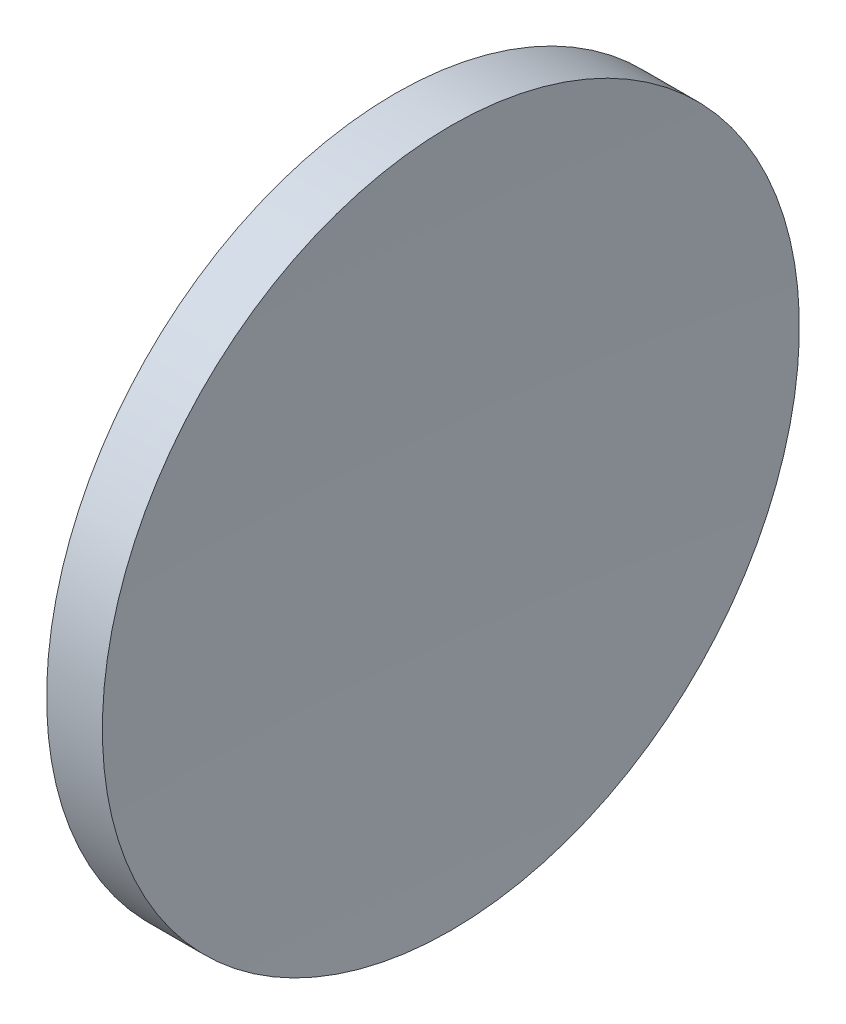
ISO-10303-21;
HEADER;
FILE_DESCRIPTION(('STEP AP214'),'2;1');
FILE_NAME('part.step','',(''),(''),'','','');
FILE_SCHEMA(('AUTOMOTIVE_DESIGN { 1 0 10303 214 1 1 1 1 }'));
ENDSEC;
DATA;
#1=APPLICATION_CONTEXT('core data for automotive mechanical design processes');
#2=APPLICATION_PROTOCOL_DEFINITION('international standard','automotive_design',2000,#1);
#3=PRODUCT_CONTEXT('',#1,'mechanical');
#4=PRODUCT('Part','Part','',(#3));
#5=PRODUCT_RELATED_PRODUCT_CATEGORY('part','',(#4));
#6=PRODUCT_DEFINITION_FORMATION('','',#4);
#7=PRODUCT_DEFINITION_CONTEXT('part definition',#1,'design');
#8=PRODUCT_DEFINITION('design','',#6,#7);
#9=PRODUCT_DEFINITION_SHAPE('','',#8);
#10=(LENGTH_UNIT() NAMED_UNIT(*) SI_UNIT(.MILLI.,.METRE.));
#11=(NAMED_UNIT(*) PLANE_ANGLE_UNIT() SI_UNIT($,.RADIAN.));
#12=(NAMED_UNIT(*) SI_UNIT($,.STERADIAN.) SOLID_ANGLE_UNIT());
#13=UNCERTAINTY_MEASURE_WITH_UNIT(LENGTH_MEASURE(1.E-05),#10,'distance_accuracy_value','');
#14=(GEOMETRIC_REPRESENTATION_CONTEXT(3) GLOBAL_UNCERTAINTY_ASSIGNED_CONTEXT((#13)) GLOBAL_UNIT_ASSIGNED_CONTEXT((#10,
#11,#12)) REPRESENTATION_CONTEXT('',''));
#15=CARTESIAN_POINT('',(0.,0.,0.));
#16=DIRECTION('',(0.,0.,1.));
#17=DIRECTION('',(1.,0.,0.));
#18=AXIS2_PLACEMENT_3D('',#15,#16,#17);
#19=CARTESIAN_POINT('',(506.755421315556,65.2168404709402,0.));
#20=DIRECTION('',(-1.,0.,0.));
#21=DIRECTION('',(0.,1.,0.));
#22=AXIS2_PLACEMENT_3D('',#19,#20,#21);
#23=SPHERICAL_SURFACE('',#22,380.);
#24=CARTESIAN_POINT('',(127.231970953131,65.2168404709403,0.));
#25=DIRECTION('',(-1.,0.,0.));
#26=DIRECTION('',(0.,-1.,0.));
#27=AXIS2_PLACEMENT_3D('',#24,#25,#26);
#28=CIRCLE('',#27,19.025);
#29=CARTESIAN_POINT('',(127.231970953131,46.1918404709403,0.));
#30=VERTEX_POINT('',#29);
#31=EDGE_CURVE('E10',#30,#30,#28,.T.);
#32=ORIENTED_EDGE('',*,*,#31,.F.);
#33=EDGE_LOOP('',(#32));
#34=FACE_BOUND('',#33,.T.);
#35=ADVANCED_FACE('F35',(#34),#23,.F.);
#36=CARTESIAN_POINT('',(115.944491297963,65.2168404709403,0.));
#37=DIRECTION('',(-1.,0.,0.));
#38=DIRECTION('',(0.,-1.,0.));
#39=AXIS2_PLACEMENT_3D('',#36,#37,#38);
#40=CYLINDRICAL_SURFACE('',#39,19.025);
#41=CARTESIAN_POINT('',(124.189724284792,65.2168404709403,0.));
#42=DIRECTION('',(-1.,0.,0.));
#43=DIRECTION('',(0.,-1.,0.));
#44=AXIS2_PLACEMENT_3D('',#41,#42,#43);
#45=CIRCLE('',#44,19.025);
#46=CARTESIAN_POINT('',(124.189724284792,46.1918404709403,0.));
#47=VERTEX_POINT('',#46);
#48=EDGE_CURVE('E41',#47,#47,#45,.T.);
#49=ORIENTED_EDGE('',*,*,#48,.F.);
#50=EDGE_LOOP('',(#49));
#51=FACE_BOUND('',#50,.T.);
#52=ORIENTED_EDGE('',*,*,#31,.T.);
#53=EDGE_LOOP('',(#52));
#54=FACE_BOUND('',#53,.T.);
#55=ADVANCED_FACE('F49',(#51,#54),#40,.T.);
#56=CARTESIAN_POINT('',(259.155421315556,65.2168404709403,0.));
#57=DIRECTION('',(-1.,0.,0.));
#58=DIRECTION('',(0.,1.,0.));
#59=AXIS2_PLACEMENT_3D('',#56,#57,#58);
#60=SPHERICAL_SURFACE('',#59,136.3);
#61=ORIENTED_EDGE('',*,*,#48,.T.);
#62=EDGE_LOOP('',(#61));
#63=FACE_BOUND('',#62,.T.);
#64=ADVANCED_FACE('F47',(#63),#60,.T.);
#65=CLOSED_SHELL('',(#35,#55,#64));
#66=MANIFOLD_SOLID_BREP('B2',#65);
#67=ADVANCED_BREP_SHAPE_REPRESENTATION('',(#18,#66),#14);
#68=SHAPE_DEFINITION_REPRESENTATION(#9,#67);
ENDSEC;
END-ISO-10303-21;
